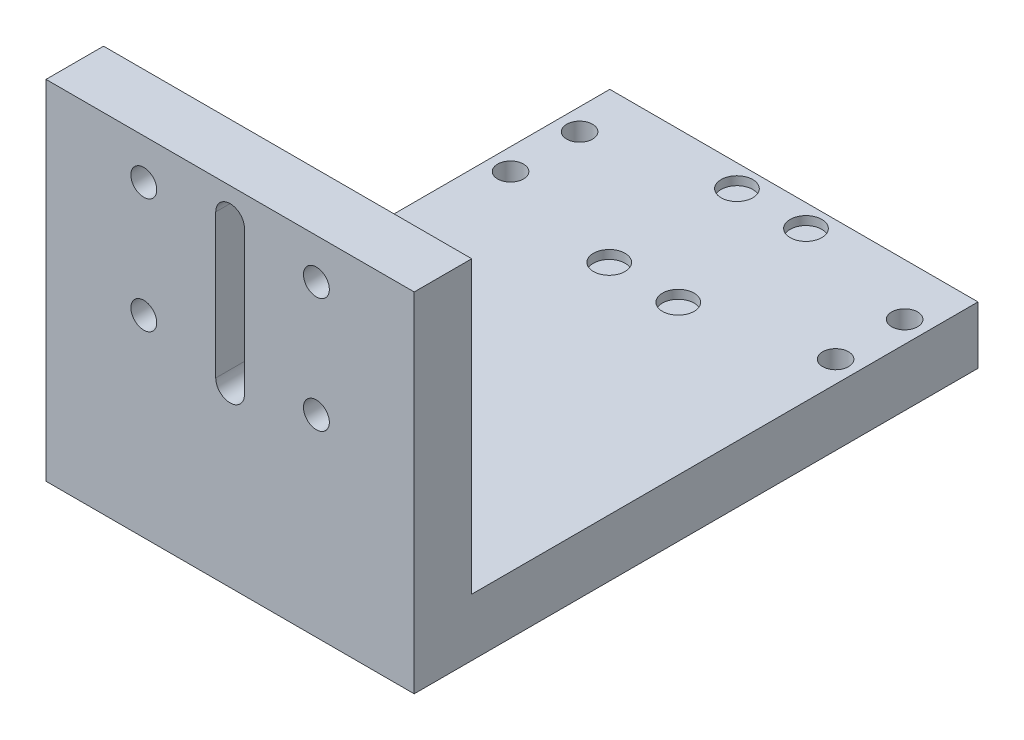
ISO-10303-21;
HEADER;
FILE_DESCRIPTION(('STEP AP214'),'2;1');
FILE_NAME('part.step','',(''),(''),'','','');
FILE_SCHEMA(('AUTOMOTIVE_DESIGN { 1 0 10303 214 1 1 1 1 }'));
ENDSEC;
DATA;
#1=APPLICATION_CONTEXT('core data for automotive mechanical design processes');
#2=APPLICATION_PROTOCOL_DEFINITION('international standard','automotive_design',2000,#1);
#3=PRODUCT_CONTEXT('',#1,'mechanical');
#4=PRODUCT('Part','Part','',(#3));
#5=PRODUCT_RELATED_PRODUCT_CATEGORY('part','',(#4));
#6=PRODUCT_DEFINITION_FORMATION('','',#4);
#7=PRODUCT_DEFINITION_CONTEXT('part definition',#1,'design');
#8=PRODUCT_DEFINITION('design','',#6,#7);
#9=PRODUCT_DEFINITION_SHAPE('','',#8);
#10=(LENGTH_UNIT() NAMED_UNIT(*) SI_UNIT(.MILLI.,.METRE.));
#11=(NAMED_UNIT(*) PLANE_ANGLE_UNIT() SI_UNIT($,.RADIAN.));
#12=(NAMED_UNIT(*) SI_UNIT($,.STERADIAN.) SOLID_ANGLE_UNIT());
#13=UNCERTAINTY_MEASURE_WITH_UNIT(LENGTH_MEASURE(1.E-05),#10,'distance_accuracy_value','');
#14=(GEOMETRIC_REPRESENTATION_CONTEXT(3) GLOBAL_UNCERTAINTY_ASSIGNED_CONTEXT((#13)) GLOBAL_UNIT_ASSIGNED_CONTEXT((#10,
#11,#12)) REPRESENTATION_CONTEXT('',''));
#15=CARTESIAN_POINT('',(0.,0.,0.));
#16=DIRECTION('',(0.,0.,1.));
#17=DIRECTION('',(1.,0.,0.));
#18=AXIS2_PLACEMENT_3D('',#15,#16,#17);
#19=CARTESIAN_POINT('',(64.,60.5,-10.));
#20=DIRECTION('',(0.,-1.,0.));
#21=DIRECTION('',(0.,0.,-1.));
#22=AXIS2_PLACEMENT_3D('',#19,#20,#21);
#23=PLANE('',#22);
#24=DIRECTION('',(0.,0.,1.));
#25=VECTOR('',#24,1.);
#26=CARTESIAN_POINT('',(0.,60.5,-10.));
#27=LINE('',#26,#25);
#28=CARTESIAN_POINT('',(0.,60.5,-10.));
#29=VERTEX_POINT('',#28);
#30=CARTESIAN_POINT('',(0.,60.5,0.));
#31=VERTEX_POINT('',#30);
#32=EDGE_CURVE('E173',#29,#31,#27,.T.);
#33=ORIENTED_EDGE('',*,*,#32,.T.);
#34=DIRECTION('',(-1.,0.,0.));
#35=VECTOR('',#34,1.);
#36=CARTESIAN_POINT('',(64.,60.5,0.));
#37=LINE('',#36,#35);
#38=CARTESIAN_POINT('',(64.,60.5,0.));
#39=VERTEX_POINT('',#38);
#40=EDGE_CURVE('E214',#39,#31,#37,.T.);
#41=ORIENTED_EDGE('',*,*,#40,.F.);
#42=DIRECTION('',(0.,0.,1.));
#43=VECTOR('',#42,1.);
#44=CARTESIAN_POINT('',(64.,60.5,-10.));
#45=LINE('',#44,#43);
#46=CARTESIAN_POINT('',(64.,60.5,-10.));
#47=VERTEX_POINT('',#46);
#48=EDGE_CURVE('E174',#47,#39,#45,.T.);
#49=ORIENTED_EDGE('',*,*,#48,.F.);
#50=DIRECTION('',(-1.,0.,0.));
#51=VECTOR('',#50,1.);
#52=CARTESIAN_POINT('',(64.,60.5,-10.));
#53=LINE('',#52,#51);
#54=EDGE_CURVE('E188',#47,#29,#53,.T.);
#55=ORIENTED_EDGE('',*,*,#54,.T.);
#56=EDGE_LOOP('',(#33,#41,#49,#55));
#57=FACE_BOUND('',#56,.T.);
#58=ADVANCED_FACE('F32',(#57),#23,.F.);
#59=CARTESIAN_POINT('',(64.,60.5,0.));
#60=DIRECTION('',(0.,0.,-1.));
#61=DIRECTION('',(0.,1.,0.));
#62=AXIS2_PLACEMENT_3D('',#59,#60,#61);
#63=PLANE('',#62);
#64=DIRECTION('',(0.,1.,0.));
#65=VECTOR('',#64,1.);
#66=CARTESIAN_POINT('',(29.5,55.3,0.));
#67=LINE('',#66,#65);
#68=CARTESIAN_POINT('',(29.5,30.3,0.));
#69=VERTEX_POINT('',#68);
#70=CARTESIAN_POINT('',(29.5,55.3,0.));
#71=VERTEX_POINT('',#70);
#72=EDGE_CURVE('E117',#69,#71,#67,.T.);
#73=ORIENTED_EDGE('',*,*,#72,.T.);
#74=CARTESIAN_POINT('',(32.,55.3,0.));
#75=DIRECTION('',(0.,0.,-1.));
#76=DIRECTION('',(0.,1.,0.));
#77=AXIS2_PLACEMENT_3D('',#74,#75,#76);
#78=CIRCLE('',#77,2.5);
#79=CARTESIAN_POINT('',(34.5,55.3,0.));
#80=VERTEX_POINT('',#79);
#81=EDGE_CURVE('E111',#71,#80,#78,.T.);
#82=ORIENTED_EDGE('',*,*,#81,.T.);
#83=DIRECTION('',(0.,-1.,0.));
#84=VECTOR('',#83,1.);
#85=CARTESIAN_POINT('',(34.5,55.3,0.));
#86=LINE('',#85,#84);
#87=CARTESIAN_POINT('',(34.5,30.3,0.));
#88=VERTEX_POINT('',#87);
#89=EDGE_CURVE('E120',#80,#88,#86,.T.);
#90=ORIENTED_EDGE('',*,*,#89,.T.);
#91=CARTESIAN_POINT('',(32.,30.3,0.));
#92=DIRECTION('',(0.,0.,-1.));
#93=DIRECTION('',(0.,1.,0.));
#94=AXIS2_PLACEMENT_3D('',#91,#92,#93);
#95=CIRCLE('',#94,2.5);
#96=EDGE_CURVE('E47',#88,#69,#95,.T.);
#97=ORIENTED_EDGE('',*,*,#96,.T.);
#98=EDGE_LOOP('',(#73,#82,#90,#97));
#99=FACE_BOUND('',#98,.T.);
#100=CARTESIAN_POINT('',(17.,53.5,0.));
#101=DIRECTION('',(0.,0.,-1.));
#102=DIRECTION('',(0.,1.,0.));
#103=AXIS2_PLACEMENT_3D('',#100,#101,#102);
#104=CIRCLE('',#103,2.25);
#105=CARTESIAN_POINT('',(17.,55.75,0.));
#106=VERTEX_POINT('',#105);
#107=EDGE_CURVE('E164',#106,#106,#104,.F.);
#108=ORIENTED_EDGE('',*,*,#107,.F.);
#109=EDGE_LOOP('',(#108));
#110=FACE_BOUND('',#109,.T.);
#111=CARTESIAN_POINT('',(47.,53.5,0.));
#112=DIRECTION('',(0.,0.,-1.));
#113=DIRECTION('',(0.,1.,0.));
#114=AXIS2_PLACEMENT_3D('',#111,#112,#113);
#115=CIRCLE('',#114,2.25);
#116=CARTESIAN_POINT('',(47.,55.75,0.));
#117=VERTEX_POINT('',#116);
#118=EDGE_CURVE('E170',#117,#117,#115,.F.);
#119=ORIENTED_EDGE('',*,*,#118,.F.);
#120=EDGE_LOOP('',(#119));
#121=FACE_BOUND('',#120,.T.);
#122=DIRECTION('',(0.,-1.,0.));
#123=VECTOR('',#122,1.);
#124=CARTESIAN_POINT('',(0.,60.5,0.));
#125=LINE('',#124,#123);
#126=CARTESIAN_POINT('',(0.,0.,0.));
#127=VERTEX_POINT('',#126);
#128=EDGE_CURVE('E191',#31,#127,#125,.T.);
#129=ORIENTED_EDGE('',*,*,#128,.T.);
#130=DIRECTION('',(-1.,0.,0.));
#131=VECTOR('',#130,1.);
#132=CARTESIAN_POINT('',(64.,0.,0.));
#133=LINE('',#132,#131);
#134=CARTESIAN_POINT('',(64.,0.,0.));
#135=VERTEX_POINT('',#134);
#136=EDGE_CURVE('E211',#135,#127,#133,.T.);
#137=ORIENTED_EDGE('',*,*,#136,.F.);
#138=DIRECTION('',(0.,-1.,0.));
#139=VECTOR('',#138,1.);
#140=CARTESIAN_POINT('',(64.,60.5,0.));
#141=LINE('',#140,#139);
#142=EDGE_CURVE('E177',#39,#135,#141,.T.);
#143=ORIENTED_EDGE('',*,*,#142,.F.);
#144=ORIENTED_EDGE('',*,*,#40,.T.);
#145=EDGE_LOOP('',(#129,#137,#143,#144));
#146=FACE_BOUND('',#145,.T.);
#147=CARTESIAN_POINT('',(47.,33.5,0.));
#148=DIRECTION('',(0.,0.,-1.));
#149=DIRECTION('',(0.,1.,0.));
#150=AXIS2_PLACEMENT_3D('',#147,#148,#149);
#151=CIRCLE('',#150,2.25);
#152=CARTESIAN_POINT('',(47.,35.75,0.));
#153=VERTEX_POINT('',#152);
#154=EDGE_CURVE('E220',#153,#153,#151,.F.);
#155=ORIENTED_EDGE('',*,*,#154,.F.);
#156=EDGE_LOOP('',(#155));
#157=FACE_BOUND('',#156,.T.);
#158=CARTESIAN_POINT('',(17.,33.5,0.));
#159=DIRECTION('',(0.,0.,-1.));
#160=DIRECTION('',(0.,1.,0.));
#161=AXIS2_PLACEMENT_3D('',#158,#159,#160);
#162=CIRCLE('',#161,2.25);
#163=CARTESIAN_POINT('',(17.,35.75,0.));
#164=VERTEX_POINT('',#163);
#165=EDGE_CURVE('E226',#164,#164,#162,.F.);
#166=ORIENTED_EDGE('',*,*,#165,.F.);
#167=EDGE_LOOP('',(#166));
#168=FACE_BOUND('',#167,.T.);
#169=ADVANCED_FACE('F124',(#99,#110,#121,#146,#157,#168),#63,.F.);
#170=CARTESIAN_POINT('',(64.,0.,0.));
#171=DIRECTION('',(0.,1.,0.));
#172=DIRECTION('',(0.,0.,1.));
#173=AXIS2_PLACEMENT_3D('',#170,#171,#172);
#174=PLANE('',#173);
#175=CARTESIAN_POINT('',(60.25,0.,-77.));
#176=DIRECTION('',(0.,1.,0.));
#177=DIRECTION('',(0.,0.,1.));
#178=AXIS2_PLACEMENT_3D('',#175,#176,#177);
#179=CIRCLE('',#178,2.25);
#180=CARTESIAN_POINT('',(60.25,0.,-74.75));
#181=VERTEX_POINT('',#180);
#182=EDGE_CURVE('E152',#181,#181,#179,.F.);
#183=ORIENTED_EDGE('',*,*,#182,.F.);
#184=EDGE_LOOP('',(#183));
#185=FACE_BOUND('',#184,.T.);
#186=CARTESIAN_POINT('',(60.25,0.,-89.));
#187=DIRECTION('',(0.,1.,0.));
#188=DIRECTION('',(0.,0.,1.));
#189=AXIS2_PLACEMENT_3D('',#186,#187,#188);
#190=CIRCLE('',#189,2.25);
#191=CARTESIAN_POINT('',(60.25,0.,-86.75));
#192=VERTEX_POINT('',#191);
#193=EDGE_CURVE('E158',#192,#192,#190,.F.);
#194=ORIENTED_EDGE('',*,*,#193,.F.);
#195=EDGE_LOOP('',(#194));
#196=FACE_BOUND('',#195,.T.);
#197=DIRECTION('',(0.,0.,-1.));
#198=VECTOR('',#197,1.);
#199=CARTESIAN_POINT('',(0.,0.,0.));
#200=LINE('',#199,#198);
#201=CARTESIAN_POINT('',(0.,0.,-98.));
#202=VERTEX_POINT('',#201);
#203=EDGE_CURVE('E193',#127,#202,#200,.T.);
#204=ORIENTED_EDGE('',*,*,#203,.T.);
#205=DIRECTION('',(-1.,0.,0.));
#206=VECTOR('',#205,1.);
#207=CARTESIAN_POINT('',(64.,0.,-98.));
#208=LINE('',#207,#206);
#209=CARTESIAN_POINT('',(64.,0.,-98.));
#210=VERTEX_POINT('',#209);
#211=EDGE_CURVE('E208',#210,#202,#208,.T.);
#212=ORIENTED_EDGE('',*,*,#211,.F.);
#213=DIRECTION('',(0.,0.,-1.));
#214=VECTOR('',#213,1.);
#215=CARTESIAN_POINT('',(64.,0.,0.));
#216=LINE('',#215,#214);
#217=EDGE_CURVE('E180',#135,#210,#216,.T.);
#218=ORIENTED_EDGE('',*,*,#217,.F.);
#219=ORIENTED_EDGE('',*,*,#136,.T.);
#220=EDGE_LOOP('',(#204,#212,#218,#219));
#221=FACE_BOUND('',#220,.T.);
#222=CARTESIAN_POINT('',(3.75,0.,-89.));
#223=DIRECTION('',(0.,1.,0.));
#224=DIRECTION('',(0.,0.,1.));
#225=AXIS2_PLACEMENT_3D('',#222,#223,#224);
#226=CIRCLE('',#225,2.25);
#227=CARTESIAN_POINT('',(3.75,0.,-86.75));
#228=VERTEX_POINT('',#227);
#229=EDGE_CURVE('E232',#228,#228,#226,.F.);
#230=ORIENTED_EDGE('',*,*,#229,.F.);
#231=EDGE_LOOP('',(#230));
#232=FACE_BOUND('',#231,.T.);
#233=CARTESIAN_POINT('',(3.75,0.,-77.));
#234=DIRECTION('',(0.,1.,0.));
#235=DIRECTION('',(0.,0.,1.));
#236=AXIS2_PLACEMENT_3D('',#233,#234,#235);
#237=CIRCLE('',#236,2.25);
#238=CARTESIAN_POINT('',(3.75,0.,-74.75));
#239=VERTEX_POINT('',#238);
#240=EDGE_CURVE('E238',#239,#239,#237,.F.);
#241=ORIENTED_EDGE('',*,*,#240,.F.);
#242=EDGE_LOOP('',(#241));
#243=FACE_BOUND('',#242,.T.);
#244=ADVANCED_FACE('F264',(#185,#196,#221,#232,#243),#174,.F.);
#245=CARTESIAN_POINT('',(64.,0.,-98.));
#246=DIRECTION('',(0.,0.,1.));
#247=DIRECTION('',(1.,0.,0.));
#248=AXIS2_PLACEMENT_3D('',#245,#246,#247);
#249=PLANE('',#248);
#250=DIRECTION('',(0.,1.,0.));
#251=VECTOR('',#250,1.);
#252=CARTESIAN_POINT('',(0.,0.,-98.));
#253=LINE('',#252,#251);
#254=CARTESIAN_POINT('',(0.,10.,-98.));
#255=VERTEX_POINT('',#254);
#256=EDGE_CURVE('E195',#202,#255,#253,.T.);
#257=ORIENTED_EDGE('',*,*,#256,.T.);
#258=DIRECTION('',(-1.,0.,0.));
#259=VECTOR('',#258,1.);
#260=CARTESIAN_POINT('',(64.,10.,-98.));
#261=LINE('',#260,#259);
#262=CARTESIAN_POINT('',(64.,10.,-98.));
#263=VERTEX_POINT('',#262);
#264=EDGE_CURVE('E205',#263,#255,#261,.T.);
#265=ORIENTED_EDGE('',*,*,#264,.F.);
#266=DIRECTION('',(0.,1.,0.));
#267=VECTOR('',#266,1.);
#268=CARTESIAN_POINT('',(64.,0.,-98.));
#269=LINE('',#268,#267);
#270=EDGE_CURVE('E182',#210,#263,#269,.T.);
#271=ORIENTED_EDGE('',*,*,#270,.F.);
#272=ORIENTED_EDGE('',*,*,#211,.T.);
#273=EDGE_LOOP('',(#257,#265,#271,#272));
#274=FACE_BOUND('',#273,.T.);
#275=ADVANCED_FACE('F254',(#274),#249,.F.);
#276=CARTESIAN_POINT('',(64.,10.,-98.));
#277=DIRECTION('',(0.,-1.,0.));
#278=DIRECTION('',(0.,0.,-1.));
#279=AXIS2_PLACEMENT_3D('',#276,#277,#278);
#280=PLANE('',#279);
#281=CARTESIAN_POINT('',(26.,10.,-94.1));
#282=DIRECTION('',(0.,1.,0.));
#283=DIRECTION('',(0.,0.,1.));
#284=AXIS2_PLACEMENT_3D('',#281,#282,#283);
#285=CIRCLE('',#284,2.75);
#286=CARTESIAN_POINT('',(26.,10.,-91.35));
#287=VERTEX_POINT('',#286);
#288=EDGE_CURVE('E592',#287,#287,#285,.T.);
#289=ORIENTED_EDGE('',*,*,#288,.F.);
#290=EDGE_LOOP('',(#289));
#291=FACE_BOUND('',#290,.T.);
#292=CARTESIAN_POINT('',(38.,10.,-94.1));
#293=DIRECTION('',(0.,1.,0.));
#294=DIRECTION('',(0.,0.,1.));
#295=AXIS2_PLACEMENT_3D('',#292,#293,#294);
#296=CIRCLE('',#295,2.75);
#297=CARTESIAN_POINT('',(38.,10.,-91.35));
#298=VERTEX_POINT('',#297);
#299=EDGE_CURVE('E133',#298,#298,#296,.T.);
#300=ORIENTED_EDGE('',*,*,#299,.F.);
#301=EDGE_LOOP('',(#300));
#302=FACE_BOUND('',#301,.T.);
#303=CARTESIAN_POINT('',(60.25,9.99999999999999,-77.));
#304=DIRECTION('',(0.,1.,0.));
#305=DIRECTION('',(0.,0.,1.));
#306=AXIS2_PLACEMENT_3D('',#303,#304,#305);
#307=CIRCLE('',#306,2.25);
#308=CARTESIAN_POINT('',(60.25,9.99999999999999,-74.75));
#309=VERTEX_POINT('',#308);
#310=EDGE_CURVE('E146',#309,#309,#307,.T.);
#311=ORIENTED_EDGE('',*,*,#310,.F.);
#312=EDGE_LOOP('',(#311));
#313=FACE_BOUND('',#312,.T.);
#314=CARTESIAN_POINT('',(60.25,9.99999999999999,-89.));
#315=DIRECTION('',(0.,1.,0.));
#316=DIRECTION('',(0.,0.,1.));
#317=AXIS2_PLACEMENT_3D('',#314,#315,#316);
#318=CIRCLE('',#317,2.25);
#319=CARTESIAN_POINT('',(60.25,9.99999999999999,-86.75));
#320=VERTEX_POINT('',#319);
#321=EDGE_CURVE('E155',#320,#320,#318,.T.);
#322=ORIENTED_EDGE('',*,*,#321,.F.);
#323=EDGE_LOOP('',(#322));
#324=FACE_BOUND('',#323,.T.);
#325=DIRECTION('',(0.,0.,1.));
#326=VECTOR('',#325,1.);
#327=CARTESIAN_POINT('',(0.,10.,-98.));
#328=LINE('',#327,#326);
#329=CARTESIAN_POINT('',(0.,9.99999999999999,-9.99999999999999));
#330=VERTEX_POINT('',#329);
#331=EDGE_CURVE('E197',#255,#330,#328,.T.);
#332=ORIENTED_EDGE('',*,*,#331,.T.);
#333=DIRECTION('',(-1.,0.,0.));
#334=VECTOR('',#333,1.);
#335=CARTESIAN_POINT('',(64.,9.99999999999999,-9.99999999999999));
#336=LINE('',#335,#334);
#337=CARTESIAN_POINT('',(64.,9.99999999999999,-9.99999999999999));
#338=VERTEX_POINT('',#337);
#339=EDGE_CURVE('E202',#338,#330,#336,.T.);
#340=ORIENTED_EDGE('',*,*,#339,.F.);
#341=DIRECTION('',(0.,0.,1.));
#342=VECTOR('',#341,1.);
#343=CARTESIAN_POINT('',(64.,10.,-98.));
#344=LINE('',#343,#342);
#345=EDGE_CURVE('E184',#263,#338,#344,.T.);
#346=ORIENTED_EDGE('',*,*,#345,.F.);
#347=ORIENTED_EDGE('',*,*,#264,.T.);
#348=EDGE_LOOP('',(#332,#340,#346,#347));
#349=FACE_BOUND('',#348,.T.);
#350=CARTESIAN_POINT('',(3.75,9.99999999999999,-89.));
#351=DIRECTION('',(0.,1.,0.));
#352=DIRECTION('',(0.,0.,1.));
#353=AXIS2_PLACEMENT_3D('',#350,#351,#352);
#354=CIRCLE('',#353,2.25);
#355=CARTESIAN_POINT('',(3.75,9.99999999999999,-86.75));
#356=VERTEX_POINT('',#355);
#357=EDGE_CURVE('E229',#356,#356,#354,.T.);
#358=ORIENTED_EDGE('',*,*,#357,.F.);
#359=EDGE_LOOP('',(#358));
#360=FACE_BOUND('',#359,.T.);
#361=CARTESIAN_POINT('',(3.75,9.99999999999999,-77.));
#362=DIRECTION('',(0.,1.,0.));
#363=DIRECTION('',(0.,0.,1.));
#364=AXIS2_PLACEMENT_3D('',#361,#362,#363);
#365=CIRCLE('',#364,2.25);
#366=CARTESIAN_POINT('',(3.75,9.99999999999999,-74.75));
#367=VERTEX_POINT('',#366);
#368=EDGE_CURVE('E235',#367,#367,#365,.T.);
#369=ORIENTED_EDGE('',*,*,#368,.F.);
#370=EDGE_LOOP('',(#369));
#371=FACE_BOUND('',#370,.T.);
#372=CARTESIAN_POINT('',(38.,9.99999999999999,-71.9));
#373=DIRECTION('',(0.,1.,0.));
#374=DIRECTION('',(0.,0.,1.));
#375=AXIS2_PLACEMENT_3D('',#372,#373,#374);
#376=CIRCLE('',#375,2.75);
#377=CARTESIAN_POINT('',(38.,9.99999999999999,-69.15));
#378=VERTEX_POINT('',#377);
#379=EDGE_CURVE('E241',#378,#378,#376,.T.);
#380=ORIENTED_EDGE('',*,*,#379,.F.);
#381=EDGE_LOOP('',(#380));
#382=FACE_BOUND('',#381,.T.);
#383=CARTESIAN_POINT('',(26.,9.99999999999999,-71.9));
#384=DIRECTION('',(0.,1.,0.));
#385=DIRECTION('',(0.,0.,1.));
#386=AXIS2_PLACEMENT_3D('',#383,#384,#385);
#387=CIRCLE('',#386,2.75);
#388=CARTESIAN_POINT('',(26.,9.99999999999999,-69.15));
#389=VERTEX_POINT('',#388);
#390=EDGE_CURVE('E40',#389,#389,#387,.T.);
#391=ORIENTED_EDGE('',*,*,#390,.F.);
#392=EDGE_LOOP('',(#391));
#393=FACE_BOUND('',#392,.T.);
#394=ADVANCED_FACE('F251',(#291,#302,#313,#324,#349,#360,#371,#382,#393),#280,.F.);
#395=CARTESIAN_POINT('',(64.,9.99999999999999,-9.99999999999999));
#396=DIRECTION('',(0.,0.,1.));
#397=DIRECTION('',(0.,-1.,0.));
#398=AXIS2_PLACEMENT_3D('',#395,#396,#397);
#399=PLANE('',#398);
#400=DIRECTION('',(0.,-1.,0.));
#401=VECTOR('',#400,1.);
#402=CARTESIAN_POINT('',(34.5,55.3,-9.99999999999999));
#403=LINE('',#402,#401);
#404=CARTESIAN_POINT('',(34.5,55.3,-10.));
#405=VERTEX_POINT('',#404);
#406=CARTESIAN_POINT('',(34.5,30.3,-9.99999999999999));
#407=VERTEX_POINT('',#406);
#408=EDGE_CURVE('E139',#405,#407,#403,.T.);
#409=ORIENTED_EDGE('',*,*,#408,.F.);
#410=CARTESIAN_POINT('',(32.,55.3,-9.99999999999999));
#411=DIRECTION('',(0.,0.,-1.));
#412=DIRECTION('',(0.,1.,0.));
#413=AXIS2_PLACEMENT_3D('',#410,#411,#412);
#414=CIRCLE('',#413,2.5);
#415=CARTESIAN_POINT('',(29.5,55.3,-9.99999999999999));
#416=VERTEX_POINT('',#415);
#417=EDGE_CURVE('E55',#416,#405,#414,.T.);
#418=ORIENTED_EDGE('',*,*,#417,.F.);
#419=DIRECTION('',(0.,1.,0.));
#420=VECTOR('',#419,1.);
#421=CARTESIAN_POINT('',(29.5,55.3,-9.99999999999999));
#422=LINE('',#421,#420);
#423=CARTESIAN_POINT('',(29.5,30.3,-9.99999999999999));
#424=VERTEX_POINT('',#423);
#425=EDGE_CURVE('E127',#424,#416,#422,.T.);
#426=ORIENTED_EDGE('',*,*,#425,.F.);
#427=CARTESIAN_POINT('',(32.,30.3,-9.99999999999999));
#428=DIRECTION('',(0.,0.,-1.));
#429=DIRECTION('',(0.,1.,0.));
#430=AXIS2_PLACEMENT_3D('',#427,#428,#429);
#431=CIRCLE('',#430,2.5);
#432=EDGE_CURVE('E130',#407,#424,#431,.T.);
#433=ORIENTED_EDGE('',*,*,#432,.F.);
#434=EDGE_LOOP('',(#409,#418,#426,#433));
#435=FACE_BOUND('',#434,.T.);
#436=CARTESIAN_POINT('',(17.,53.5,-9.99999999999999));
#437=DIRECTION('',(0.,0.,-1.));
#438=DIRECTION('',(0.,1.,0.));
#439=AXIS2_PLACEMENT_3D('',#436,#437,#438);
#440=CIRCLE('',#439,2.25);
#441=CARTESIAN_POINT('',(17.,55.75,-9.99999999999999));
#442=VERTEX_POINT('',#441);
#443=EDGE_CURVE('E161',#442,#442,#440,.T.);
#444=ORIENTED_EDGE('',*,*,#443,.F.);
#445=EDGE_LOOP('',(#444));
#446=FACE_BOUND('',#445,.T.);
#447=CARTESIAN_POINT('',(47.,53.5,-9.99999999999999));
#448=DIRECTION('',(0.,0.,-1.));
#449=DIRECTION('',(0.,1.,0.));
#450=AXIS2_PLACEMENT_3D('',#447,#448,#449);
#451=CIRCLE('',#450,2.25);
#452=CARTESIAN_POINT('',(47.,55.75,-9.99999999999999));
#453=VERTEX_POINT('',#452);
#454=EDGE_CURVE('E167',#453,#453,#451,.T.);
#455=ORIENTED_EDGE('',*,*,#454,.F.);
#456=EDGE_LOOP('',(#455));
#457=FACE_BOUND('',#456,.T.);
#458=DIRECTION('',(0.,1.,0.));
#459=VECTOR('',#458,1.);
#460=CARTESIAN_POINT('',(0.,9.99999999999999,-9.99999999999999));
#461=LINE('',#460,#459);
#462=EDGE_CURVE('E178',#330,#29,#461,.T.);
#463=ORIENTED_EDGE('',*,*,#462,.T.);
#464=ORIENTED_EDGE('',*,*,#54,.F.);
#465=DIRECTION('',(0.,1.,0.));
#466=VECTOR('',#465,1.);
#467=CARTESIAN_POINT('',(64.,9.99999999999999,-9.99999999999999));
#468=LINE('',#467,#466);
#469=EDGE_CURVE('E186',#338,#47,#468,.T.);
#470=ORIENTED_EDGE('',*,*,#469,.F.);
#471=ORIENTED_EDGE('',*,*,#339,.T.);
#472=EDGE_LOOP('',(#463,#464,#470,#471));
#473=FACE_BOUND('',#472,.T.);
#474=CARTESIAN_POINT('',(47.,33.5,-9.99999999999999));
#475=DIRECTION('',(0.,0.,-1.));
#476=DIRECTION('',(0.,1.,0.));
#477=AXIS2_PLACEMENT_3D('',#474,#475,#476);
#478=CIRCLE('',#477,2.25);
#479=CARTESIAN_POINT('',(47.,35.75,-9.99999999999999));
#480=VERTEX_POINT('',#479);
#481=EDGE_CURVE('E217',#480,#480,#478,.T.);
#482=ORIENTED_EDGE('',*,*,#481,.F.);
#483=EDGE_LOOP('',(#482));
#484=FACE_BOUND('',#483,.T.);
#485=CARTESIAN_POINT('',(17.,33.5,-9.99999999999999));
#486=DIRECTION('',(0.,0.,-1.));
#487=DIRECTION('',(0.,1.,0.));
#488=AXIS2_PLACEMENT_3D('',#485,#486,#487);
#489=CIRCLE('',#488,2.25);
#490=CARTESIAN_POINT('',(17.,35.75,-9.99999999999999));
#491=VERTEX_POINT('',#490);
#492=EDGE_CURVE('E223',#491,#491,#489,.T.);
#493=ORIENTED_EDGE('',*,*,#492,.F.);
#494=EDGE_LOOP('',(#493));
#495=FACE_BOUND('',#494,.T.);
#496=ADVANCED_FACE('F253',(#435,#446,#457,#473,#484,#495),#399,.F.);
#497=CARTESIAN_POINT('',(64.,0.,0.));
#498=DIRECTION('',(1.,0.,0.));
#499=DIRECTION('',(0.,0.,-1.));
#500=AXIS2_PLACEMENT_3D('',#497,#498,#499);
#501=PLANE('',#500);
#502=ORIENTED_EDGE('',*,*,#48,.T.);
#503=ORIENTED_EDGE('',*,*,#142,.T.);
#504=ORIENTED_EDGE('',*,*,#217,.T.);
#505=ORIENTED_EDGE('',*,*,#270,.T.);
#506=ORIENTED_EDGE('',*,*,#345,.T.);
#507=ORIENTED_EDGE('',*,*,#469,.T.);
#508=EDGE_LOOP('',(#502,#503,#504,#505,#506,#507));
#509=FACE_BOUND('',#508,.T.);
#510=ADVANCED_FACE('F261',(#509),#501,.T.);
#511=CARTESIAN_POINT('',(0.,0.,0.));
#512=DIRECTION('',(1.,0.,0.));
#513=DIRECTION('',(0.,0.,-1.));
#514=AXIS2_PLACEMENT_3D('',#511,#512,#513);
#515=PLANE('',#514);
#516=ORIENTED_EDGE('',*,*,#32,.F.);
#517=ORIENTED_EDGE('',*,*,#462,.F.);
#518=ORIENTED_EDGE('',*,*,#331,.F.);
#519=ORIENTED_EDGE('',*,*,#256,.F.);
#520=ORIENTED_EDGE('',*,*,#203,.F.);
#521=ORIENTED_EDGE('',*,*,#128,.F.);
#522=EDGE_LOOP('',(#516,#517,#518,#519,#520,#521));
#523=FACE_BOUND('',#522,.T.);
#524=ADVANCED_FACE('F427',(#523),#515,.F.);
#525=CARTESIAN_POINT('',(47.,53.5,0.00100000000000273));
#526=DIRECTION('',(0.,0.,-1.));
#527=DIRECTION('',(0.,1.,0.));
#528=AXIS2_PLACEMENT_3D('',#525,#526,#527);
#529=CYLINDRICAL_SURFACE('',#528,2.25);
#530=ORIENTED_EDGE('',*,*,#454,.T.);
#531=EDGE_LOOP('',(#530));
#532=FACE_BOUND('',#531,.T.);
#533=ORIENTED_EDGE('',*,*,#118,.T.);
#534=EDGE_LOOP('',(#533));
#535=FACE_BOUND('',#534,.T.);
#536=ADVANCED_FACE('F419',(#532,#535),#529,.F.);
#537=CARTESIAN_POINT('',(17.,53.5,0.00100000000000273));
#538=DIRECTION('',(0.,0.,-1.));
#539=DIRECTION('',(0.,1.,0.));
#540=AXIS2_PLACEMENT_3D('',#537,#538,#539);
#541=CYLINDRICAL_SURFACE('',#540,2.25);
#542=ORIENTED_EDGE('',*,*,#443,.T.);
#543=EDGE_LOOP('',(#542));
#544=FACE_BOUND('',#543,.T.);
#545=ORIENTED_EDGE('',*,*,#107,.T.);
#546=EDGE_LOOP('',(#545));
#547=FACE_BOUND('',#546,.T.);
#548=ADVANCED_FACE('F282',(#544,#547),#541,.F.);
#549=CARTESIAN_POINT('',(47.,33.5,0.0010000000000048));
#550=DIRECTION('',(0.,0.,-1.));
#551=DIRECTION('',(0.,1.,0.));
#552=AXIS2_PLACEMENT_3D('',#549,#550,#551);
#553=CYLINDRICAL_SURFACE('',#552,2.25);
#554=ORIENTED_EDGE('',*,*,#481,.T.);
#555=EDGE_LOOP('',(#554));
#556=FACE_BOUND('',#555,.T.);
#557=ORIENTED_EDGE('',*,*,#154,.T.);
#558=EDGE_LOOP('',(#557));
#559=FACE_BOUND('',#558,.T.);
#560=ADVANCED_FACE('F278',(#556,#559),#553,.F.);
#561=CARTESIAN_POINT('',(17.,33.5,0.0010000000000048));
#562=DIRECTION('',(0.,0.,-1.));
#563=DIRECTION('',(0.,1.,0.));
#564=AXIS2_PLACEMENT_3D('',#561,#562,#563);
#565=CYLINDRICAL_SURFACE('',#564,2.25);
#566=ORIENTED_EDGE('',*,*,#492,.T.);
#567=EDGE_LOOP('',(#566));
#568=FACE_BOUND('',#567,.T.);
#569=ORIENTED_EDGE('',*,*,#165,.T.);
#570=EDGE_LOOP('',(#569));
#571=FACE_BOUND('',#570,.T.);
#572=ADVANCED_FACE('F281',(#568,#571),#565,.F.);
#573=CARTESIAN_POINT('',(60.25,-0.001000000000001,-89.));
#574=DIRECTION('',(0.,1.,0.));
#575=DIRECTION('',(0.,0.,1.));
#576=AXIS2_PLACEMENT_3D('',#573,#574,#575);
#577=CYLINDRICAL_SURFACE('',#576,2.25);
#578=ORIENTED_EDGE('',*,*,#321,.T.);
#579=EDGE_LOOP('',(#578));
#580=FACE_BOUND('',#579,.T.);
#581=ORIENTED_EDGE('',*,*,#193,.T.);
#582=EDGE_LOOP('',(#581));
#583=FACE_BOUND('',#582,.T.);
#584=ADVANCED_FACE('F286',(#580,#583),#577,.F.);
#585=CARTESIAN_POINT('',(60.25,-0.00100000000000242,-77.));
#586=DIRECTION('',(0.,1.,0.));
#587=DIRECTION('',(0.,0.,1.));
#588=AXIS2_PLACEMENT_3D('',#585,#586,#587);
#589=CYLINDRICAL_SURFACE('',#588,2.25);
#590=ORIENTED_EDGE('',*,*,#310,.T.);
#591=EDGE_LOOP('',(#590));
#592=FACE_BOUND('',#591,.T.);
#593=ORIENTED_EDGE('',*,*,#182,.T.);
#594=EDGE_LOOP('',(#593));
#595=FACE_BOUND('',#594,.T.);
#596=ADVANCED_FACE('F292',(#592,#595),#589,.F.);
#597=CARTESIAN_POINT('',(3.75,-0.001000000000001,-89.));
#598=DIRECTION('',(0.,1.,0.));
#599=DIRECTION('',(0.,0.,1.));
#600=AXIS2_PLACEMENT_3D('',#597,#598,#599);
#601=CYLINDRICAL_SURFACE('',#600,2.25);
#602=ORIENTED_EDGE('',*,*,#357,.T.);
#603=EDGE_LOOP('',(#602));
#604=FACE_BOUND('',#603,.T.);
#605=ORIENTED_EDGE('',*,*,#229,.T.);
#606=EDGE_LOOP('',(#605));
#607=FACE_BOUND('',#606,.T.);
#608=ADVANCED_FACE('F288',(#604,#607),#601,.F.);
#609=CARTESIAN_POINT('',(3.75,-0.00100000000000242,-77.));
#610=DIRECTION('',(0.,1.,0.));
#611=DIRECTION('',(0.,0.,1.));
#612=AXIS2_PLACEMENT_3D('',#609,#610,#611);
#613=CYLINDRICAL_SURFACE('',#612,2.25);
#614=ORIENTED_EDGE('',*,*,#368,.T.);
#615=EDGE_LOOP('',(#614));
#616=FACE_BOUND('',#615,.T.);
#617=ORIENTED_EDGE('',*,*,#240,.T.);
#618=EDGE_LOOP('',(#617));
#619=FACE_BOUND('',#618,.T.);
#620=ADVANCED_FACE('F291',(#616,#619),#613,.F.);
#621=CARTESIAN_POINT('',(32.,55.3,0.));
#622=DIRECTION('',(0.,0.,-1.));
#623=DIRECTION('',(0.,1.,0.));
#624=AXIS2_PLACEMENT_3D('',#621,#622,#623);
#625=CYLINDRICAL_SURFACE('',#624,2.5);
#626=ORIENTED_EDGE('',*,*,#417,.T.);
#627=DIRECTION('',(0.,0.,-1.));
#628=VECTOR('',#627,1.);
#629=CARTESIAN_POINT('',(34.5,55.3,0.));
#630=LINE('',#629,#628);
#631=EDGE_CURVE('E107',#80,#405,#630,.T.);
#632=ORIENTED_EDGE('',*,*,#631,.F.);
#633=ORIENTED_EDGE('',*,*,#81,.F.);
#634=DIRECTION('',(0.,0.,-1.));
#635=VECTOR('',#634,1.);
#636=CARTESIAN_POINT('',(29.5,55.3,0.));
#637=LINE('',#636,#635);
#638=EDGE_CURVE('E144',#71,#416,#637,.T.);
#639=ORIENTED_EDGE('',*,*,#638,.T.);
#640=EDGE_LOOP('',(#626,#632,#633,#639));
#641=FACE_BOUND('',#640,.T.);
#642=ADVANCED_FACE('F109',(#641),#625,.F.);
#643=CARTESIAN_POINT('',(29.5,55.3,0.));
#644=DIRECTION('',(-1.,0.,0.));
#645=DIRECTION('',(0.,-1.,0.));
#646=AXIS2_PLACEMENT_3D('',#643,#644,#645);
#647=PLANE('',#646);
#648=ORIENTED_EDGE('',*,*,#425,.T.);
#649=ORIENTED_EDGE('',*,*,#638,.F.);
#650=ORIENTED_EDGE('',*,*,#72,.F.);
#651=DIRECTION('',(0.,0.,-1.));
#652=VECTOR('',#651,1.);
#653=CARTESIAN_POINT('',(29.5,30.3,0.));
#654=LINE('',#653,#652);
#655=EDGE_CURVE('E147',#69,#424,#654,.T.);
#656=ORIENTED_EDGE('',*,*,#655,.T.);
#657=EDGE_LOOP('',(#648,#649,#650,#656));
#658=FACE_BOUND('',#657,.T.);
#659=ADVANCED_FACE('F366',(#658),#647,.F.);
#660=CARTESIAN_POINT('',(32.,30.3,0.));
#661=DIRECTION('',(0.,0.,-1.));
#662=DIRECTION('',(0.,1.,0.));
#663=AXIS2_PLACEMENT_3D('',#660,#661,#662);
#664=CYLINDRICAL_SURFACE('',#663,2.5);
#665=ORIENTED_EDGE('',*,*,#432,.T.);
#666=ORIENTED_EDGE('',*,*,#655,.F.);
#667=ORIENTED_EDGE('',*,*,#96,.F.);
#668=DIRECTION('',(0.,0.,-1.));
#669=VECTOR('',#668,1.);
#670=CARTESIAN_POINT('',(34.5,30.3,0.));
#671=LINE('',#670,#669);
#672=EDGE_CURVE('E116',#88,#407,#671,.T.);
#673=ORIENTED_EDGE('',*,*,#672,.T.);
#674=EDGE_LOOP('',(#665,#666,#667,#673));
#675=FACE_BOUND('',#674,.T.);
#676=ADVANCED_FACE('F359',(#675),#664,.F.);
#677=CARTESIAN_POINT('',(34.5,55.3,0.));
#678=DIRECTION('',(1.,0.,0.));
#679=DIRECTION('',(0.,0.,-1.));
#680=AXIS2_PLACEMENT_3D('',#677,#678,#679);
#681=PLANE('',#680);
#682=ORIENTED_EDGE('',*,*,#408,.T.);
#683=ORIENTED_EDGE('',*,*,#672,.F.);
#684=ORIENTED_EDGE('',*,*,#89,.F.);
#685=ORIENTED_EDGE('',*,*,#631,.T.);
#686=EDGE_LOOP('',(#682,#683,#684,#685));
#687=FACE_BOUND('',#686,.T.);
#688=ADVANCED_FACE('F121',(#687),#681,.F.);
#689=CARTESIAN_POINT('',(38.,8.5,-94.1));
#690=DIRECTION('',(0.,1.,0.));
#691=DIRECTION('',(0.,0.,1.));
#692=AXIS2_PLACEMENT_3D('',#689,#690,#691);
#693=CYLINDRICAL_SURFACE('',#692,2.75);
#694=CARTESIAN_POINT('',(38.,8.5,-94.1));
#695=DIRECTION('',(0.,1.,0.));
#696=DIRECTION('',(0.,0.,1.));
#697=AXIS2_PLACEMENT_3D('',#694,#695,#696);
#698=CIRCLE('',#697,2.75);
#699=CARTESIAN_POINT('',(38.,8.5,-91.35));
#700=VERTEX_POINT('',#699);
#701=EDGE_CURVE('E140',#700,#700,#698,.T.);
#702=ORIENTED_EDGE('',*,*,#701,.F.);
#703=EDGE_LOOP('',(#702));
#704=FACE_BOUND('',#703,.T.);
#705=ORIENTED_EDGE('',*,*,#299,.T.);
#706=EDGE_LOOP('',(#705));
#707=FACE_BOUND('',#706,.T.);
#708=ADVANCED_FACE('F344',(#704,#707),#693,.F.);
#709=CARTESIAN_POINT('',(38.,8.5,-94.1));
#710=DIRECTION('',(0.,1.,0.));
#711=DIRECTION('',(0.,0.,1.));
#712=AXIS2_PLACEMENT_3D('',#709,#710,#711);
#713=PLANE('',#712);
#714=ORIENTED_EDGE('',*,*,#701,.T.);
#715=EDGE_LOOP('',(#714));
#716=FACE_BOUND('',#715,.T.);
#717=ADVANCED_FACE('F336',(#716),#713,.T.);
#718=CARTESIAN_POINT('',(26.,8.5,-94.1));
#719=DIRECTION('',(0.,1.,0.));
#720=DIRECTION('',(0.,0.,1.));
#721=AXIS2_PLACEMENT_3D('',#718,#719,#720);
#722=CYLINDRICAL_SURFACE('',#721,2.75);
#723=CARTESIAN_POINT('',(26.,8.5,-94.1));
#724=DIRECTION('',(0.,1.,0.));
#725=DIRECTION('',(0.,0.,1.));
#726=AXIS2_PLACEMENT_3D('',#723,#724,#725);
#727=CIRCLE('',#726,2.75);
#728=CARTESIAN_POINT('',(26.,8.5,-91.35));
#729=VERTEX_POINT('',#728);
#730=EDGE_CURVE('E590',#729,#729,#727,.T.);
#731=ORIENTED_EDGE('',*,*,#730,.F.);
#732=EDGE_LOOP('',(#731));
#733=FACE_BOUND('',#732,.T.);
#734=ORIENTED_EDGE('',*,*,#288,.T.);
#735=EDGE_LOOP('',(#734));
#736=FACE_BOUND('',#735,.T.);
#737=ADVANCED_FACE('F328',(#733,#736),#722,.F.);
#738=CARTESIAN_POINT('',(26.,8.5,-94.1));
#739=DIRECTION('',(0.,1.,0.));
#740=DIRECTION('',(0.,0.,1.));
#741=AXIS2_PLACEMENT_3D('',#738,#739,#740);
#742=PLANE('',#741);
#743=ORIENTED_EDGE('',*,*,#730,.T.);
#744=EDGE_LOOP('',(#743));
#745=FACE_BOUND('',#744,.T.);
#746=ADVANCED_FACE('F303',(#745),#742,.T.);
#747=CARTESIAN_POINT('',(38.,8.49999999999999,-71.9));
#748=DIRECTION('',(0.,1.,0.));
#749=DIRECTION('',(0.,0.,1.));
#750=AXIS2_PLACEMENT_3D('',#747,#748,#749);
#751=PLANE('',#750);
#752=CARTESIAN_POINT('',(38.,8.49999999999999,-71.9));
#753=DIRECTION('',(0.,1.,0.));
#754=DIRECTION('',(0.,0.,1.));
#755=AXIS2_PLACEMENT_3D('',#752,#753,#754);
#756=CIRCLE('',#755,2.75);
#757=CARTESIAN_POINT('',(38.,8.49999999999999,-69.15));
#758=VERTEX_POINT('',#757);
#759=EDGE_CURVE('E244',#758,#758,#756,.T.);
#760=ORIENTED_EDGE('',*,*,#759,.T.);
#761=EDGE_LOOP('',(#760));
#762=FACE_BOUND('',#761,.T.);
#763=ADVANCED_FACE('F300',(#762),#751,.T.);
#764=CARTESIAN_POINT('',(38.,8.49999999999999,-71.9));
#765=DIRECTION('',(0.,1.,0.));
#766=DIRECTION('',(0.,0.,1.));
#767=AXIS2_PLACEMENT_3D('',#764,#765,#766);
#768=CYLINDRICAL_SURFACE('',#767,2.75);
#769=ORIENTED_EDGE('',*,*,#759,.F.);
#770=EDGE_LOOP('',(#769));
#771=FACE_BOUND('',#770,.T.);
#772=ORIENTED_EDGE('',*,*,#379,.T.);
#773=EDGE_LOOP('',(#772));
#774=FACE_BOUND('',#773,.T.);
#775=ADVANCED_FACE('F297',(#771,#774),#768,.F.);
#776=CARTESIAN_POINT('',(26.,8.49999999999999,-71.9));
#777=DIRECTION('',(0.,1.,0.));
#778=DIRECTION('',(0.,0.,1.));
#779=AXIS2_PLACEMENT_3D('',#776,#777,#778);
#780=PLANE('',#779);
#781=CARTESIAN_POINT('',(26.,8.49999999999999,-71.9));
#782=DIRECTION('',(0.,1.,0.));
#783=DIRECTION('',(0.,0.,1.));
#784=AXIS2_PLACEMENT_3D('',#781,#782,#783);
#785=CIRCLE('',#784,2.75);
#786=CARTESIAN_POINT('',(26.,8.49999999999999,-69.15));
#787=VERTEX_POINT('',#786);
#788=EDGE_CURVE('E11',#787,#787,#785,.T.);
#789=ORIENTED_EDGE('',*,*,#788,.T.);
#790=EDGE_LOOP('',(#789));
#791=FACE_BOUND('',#790,.T.);
#792=ADVANCED_FACE('F34',(#791),#780,.T.);
#793=CARTESIAN_POINT('',(26.,8.49999999999999,-71.9));
#794=DIRECTION('',(0.,1.,0.));
#795=DIRECTION('',(0.,0.,1.));
#796=AXIS2_PLACEMENT_3D('',#793,#794,#795);
#797=CYLINDRICAL_SURFACE('',#796,2.75);
#798=ORIENTED_EDGE('',*,*,#788,.F.);
#799=EDGE_LOOP('',(#798));
#800=FACE_BOUND('',#799,.T.);
#801=ORIENTED_EDGE('',*,*,#390,.T.);
#802=EDGE_LOOP('',(#801));
#803=FACE_BOUND('',#802,.T.);
#804=ADVANCED_FACE('F249',(#800,#803),#797,.F.);
#805=CLOSED_SHELL('',(#58,#169,#244,#275,#394,#496,#510,#524,#536,#548,#560,#572,#584,#596,#608,
#620,#642,#659,#676,#688,#708,#717,#737,#746,#763,#775,#792,#804));
#806=MANIFOLD_SOLID_BREP('B2',#805);
#807=ADVANCED_BREP_SHAPE_REPRESENTATION('',(#18,#806),#14);
#808=SHAPE_DEFINITION_REPRESENTATION(#9,#807);
ENDSEC;
END-ISO-10303-21;
